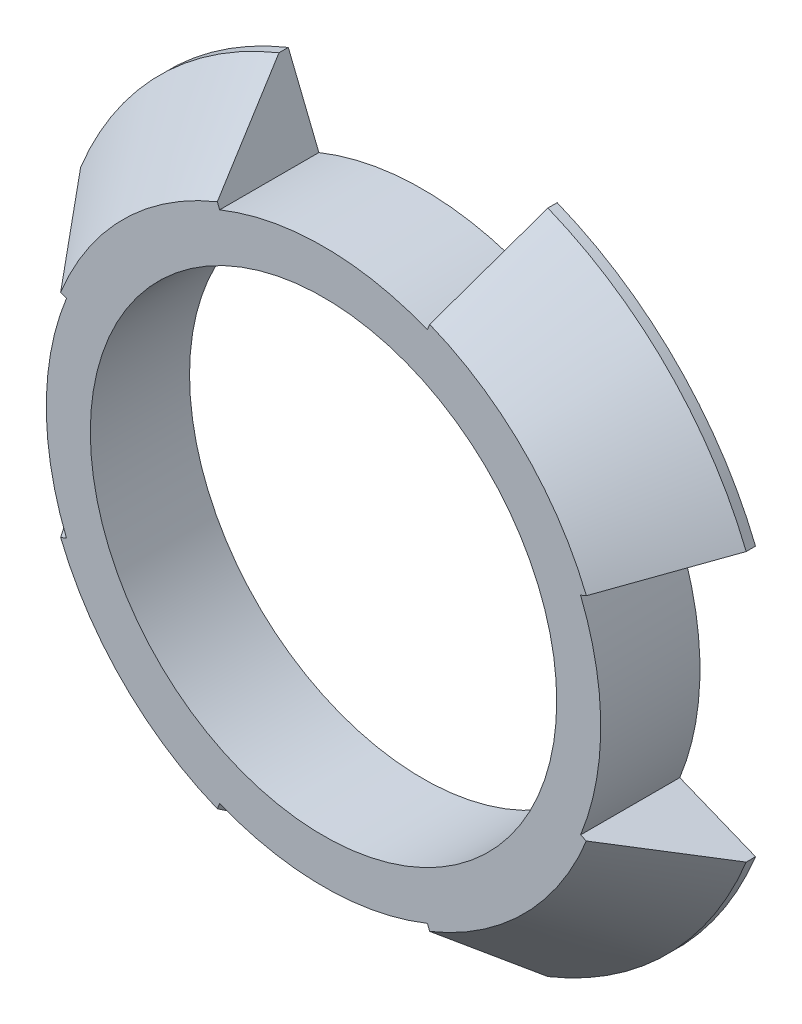
ISO-10303-21;
HEADER;
FILE_DESCRIPTION(('STEP AP214'),'2;1');
FILE_NAME('part.step','',(''),(''),'','','');
FILE_SCHEMA(('AUTOMOTIVE_DESIGN { 1 0 10303 214 1 1 1 1 }'));
ENDSEC;
DATA;
#1=APPLICATION_CONTEXT('core data for automotive mechanical design processes');
#2=APPLICATION_PROTOCOL_DEFINITION('international standard','automotive_design',2000,#1);
#3=PRODUCT_CONTEXT('',#1,'mechanical');
#4=PRODUCT('Part','Part','',(#3));
#5=PRODUCT_RELATED_PRODUCT_CATEGORY('part','',(#4));
#6=PRODUCT_DEFINITION_FORMATION('','',#4);
#7=PRODUCT_DEFINITION_CONTEXT('part definition',#1,'design');
#8=PRODUCT_DEFINITION('design','',#6,#7);
#9=PRODUCT_DEFINITION_SHAPE('','',#8);
#10=(LENGTH_UNIT() NAMED_UNIT(*) SI_UNIT(.MILLI.,.METRE.));
#11=(NAMED_UNIT(*) PLANE_ANGLE_UNIT() SI_UNIT($,.RADIAN.));
#12=(NAMED_UNIT(*) SI_UNIT($,.STERADIAN.) SOLID_ANGLE_UNIT());
#13=UNCERTAINTY_MEASURE_WITH_UNIT(LENGTH_MEASURE(1.E-05),#10,'distance_accuracy_value','');
#14=(GEOMETRIC_REPRESENTATION_CONTEXT(3) GLOBAL_UNCERTAINTY_ASSIGNED_CONTEXT((#13)) GLOBAL_UNIT_ASSIGNED_CONTEXT((#10,
#11,#12)) REPRESENTATION_CONTEXT('',''));
#15=CARTESIAN_POINT('',(0.,0.,0.));
#16=DIRECTION('',(0.,0.,1.));
#17=DIRECTION('',(1.,0.,0.));
#18=AXIS2_PLACEMENT_3D('',#15,#16,#17);
#19=CARTESIAN_POINT('',(-12.0825477842231,-4.88166617973261,4.318));
#20=DIRECTION('',(-0.374606593415913,0.927183854566787,0.));
#21=DIRECTION('',(-0.927183854566787,-0.374606593415913,0.));
#22=AXIS2_PLACEMENT_3D('',#19,#20,#21);
#23=PLANE('',#22);
#24=DIRECTION('',(0.,0.,1.));
#25=VECTOR('',#24,1.);
#26=CARTESIAN_POINT('',(14.4835389921878,5.85172959574998,-0.762));
#27=LINE('',#26,#25);
#28=CARTESIAN_POINT('',(14.4835389921878,5.85172959574998,0.405352706259439));
#29=VERTEX_POINT('',#28);
#30=CARTESIAN_POINT('',(14.4835389921878,5.85172959574998,0.));
#31=VERTEX_POINT('',#30);
#32=EDGE_CURVE('E316',#29,#31,#27,.F.);
#33=ORIENTED_EDGE('',*,*,#32,.F.);
#34=DIRECTION('',(0.595982293616936,0.240792476754632,-0.76604444311898));
#35=VECTOR('',#34,1.);
#36=CARTESIAN_POINT('',(0.,0.,19.0217355761737));
#37=LINE('',#36,#35);
#38=CARTESIAN_POINT('',(11.43950084377,4.62185835134652,4.318));
#39=VERTEX_POINT('',#38);
#40=EDGE_CURVE('E201',#29,#39,#37,.F.);
#41=ORIENTED_EDGE('',*,*,#40,.T.);
#42=DIRECTION('',(0.927183854566787,0.374606593415913,0.));
#43=VECTOR('',#42,1.);
#44=CARTESIAN_POINT('',(-12.0825477842231,-4.88166617973261,4.318));
#45=LINE('',#44,#43);
#46=CARTESIAN_POINT('',(11.1864732053483,4.519628549563,4.318));
#47=VERTEX_POINT('',#46);
#48=EDGE_CURVE('E299',#47,#39,#45,.T.);
#49=ORIENTED_EDGE('',*,*,#48,.F.);
#50=DIRECTION('',(0.,0.,-1.));
#51=VECTOR('',#50,1.);
#52=CARTESIAN_POINT('',(11.1864732053483,4.519628549563,4.318));
#53=LINE('',#52,#51);
#54=CARTESIAN_POINT('',(11.1864732053483,4.519628549563,0.));
#55=VERTEX_POINT('',#54);
#56=EDGE_CURVE('E221',#47,#55,#53,.T.);
#57=ORIENTED_EDGE('',*,*,#56,.T.);
#58=DIRECTION('',(0.927183854566787,0.374606593415913,0.));
#59=VECTOR('',#58,1.);
#60=CARTESIAN_POINT('',(-12.0825477842231,-4.88166617973261,0.));
#61=LINE('',#60,#59);
#62=EDGE_CURVE('E267',#55,#31,#61,.T.);
#63=ORIENTED_EDGE('',*,*,#62,.T.);
#64=EDGE_LOOP('',(#33,#41,#49,#57,#63));
#65=FACE_BOUND('',#64,.T.);
#66=ADVANCED_FACE('F36',(#65),#23,.F.);
#67=CARTESIAN_POINT('',(-12.0825477842231,-29.9053551765047,4.318));
#68=DIRECTION('',(-0.927183854566787,0.374606593415913,0.));
#69=DIRECTION('',(-0.374606593415913,-0.927183854566787,0.));
#70=AXIS2_PLACEMENT_3D('',#67,#68,#69);
#71=PLANE('',#70);
#72=DIRECTION('',(0.240792476754631,0.595982293616936,-0.76604444311898));
#73=VECTOR('',#72,1.);
#74=CARTESIAN_POINT('',(0.,0.,19.0217355761737));
#75=LINE('',#74,#73);
#76=CARTESIAN_POINT('',(4.62185835134651,11.43950084377,4.318));
#77=VERTEX_POINT('',#76);
#78=CARTESIAN_POINT('',(5.85172959574997,14.4835389921878,0.405352706259439));
#79=VERTEX_POINT('',#78);
#80=EDGE_CURVE('E203',#77,#79,#75,.T.);
#81=ORIENTED_EDGE('',*,*,#80,.T.);
#82=DIRECTION('',(0.,0.,1.));
#83=VECTOR('',#82,1.);
#84=CARTESIAN_POINT('',(5.85172959574997,14.4835389921878,-0.762));
#85=LINE('',#84,#83);
#86=CARTESIAN_POINT('',(5.85172959574997,14.4835389921878,0.));
#87=VERTEX_POINT('',#86);
#88=EDGE_CURVE('E59',#79,#87,#85,.F.);
#89=ORIENTED_EDGE('',*,*,#88,.T.);
#90=DIRECTION('',(0.374606593415913,0.927183854566787,0.));
#91=VECTOR('',#90,1.);
#92=CARTESIAN_POINT('',(-12.0825477842231,-29.9053551765047,0.));
#93=LINE('',#92,#91);
#94=CARTESIAN_POINT('',(4.51962854956299,11.1864732053483,0.));
#95=VERTEX_POINT('',#94);
#96=EDGE_CURVE('E264',#95,#87,#93,.T.);
#97=ORIENTED_EDGE('',*,*,#96,.F.);
#98=DIRECTION('',(0.,0.,-1.));
#99=VECTOR('',#98,1.);
#100=CARTESIAN_POINT('',(4.51962854956299,11.1864732053483,4.318));
#101=LINE('',#100,#99);
#102=CARTESIAN_POINT('',(4.51962854956299,11.1864732053483,4.318));
#103=VERTEX_POINT('',#102);
#104=EDGE_CURVE('E224',#103,#95,#101,.T.);
#105=ORIENTED_EDGE('',*,*,#104,.F.);
#106=DIRECTION('',(0.374606593415913,0.927183854566787,0.));
#107=VECTOR('',#106,1.);
#108=CARTESIAN_POINT('',(-12.0825477842231,-29.9053551765047,4.318));
#109=LINE('',#108,#107);
#110=EDGE_CURVE('E296',#103,#77,#109,.T.);
#111=ORIENTED_EDGE('',*,*,#110,.T.);
#112=EDGE_LOOP('',(#81,#89,#97,#105,#111));
#113=FACE_BOUND('',#112,.T.);
#114=ADVANCED_FACE('F372',(#113),#71,.T.);
#115=CARTESIAN_POINT('',(12.0825477842231,-29.9053551765047,4.318));
#116=DIRECTION('',(-0.927183854566787,-0.374606593415913,0.));
#117=DIRECTION('',(0.374606593415913,-0.927183854566787,0.));
#118=AXIS2_PLACEMENT_3D('',#115,#116,#117);
#119=PLANE('',#118);
#120=DIRECTION('',(0.,0.,1.));
#121=VECTOR('',#120,1.);
#122=CARTESIAN_POINT('',(-5.85172959574998,14.4835389921878,-0.762));
#123=LINE('',#122,#121);
#124=CARTESIAN_POINT('',(-5.85172959574998,14.4835389921878,0.405352706259439));
#125=VERTEX_POINT('',#124);
#126=CARTESIAN_POINT('',(-5.85172959574998,14.4835389921878,0.));
#127=VERTEX_POINT('',#126);
#128=EDGE_CURVE('E310',#125,#127,#123,.F.);
#129=ORIENTED_EDGE('',*,*,#128,.F.);
#130=DIRECTION('',(-0.240792476754632,0.595982293616935,-0.766044443118979));
#131=VECTOR('',#130,1.);
#132=CARTESIAN_POINT('',(0.,0.,19.0217355761737));
#133=LINE('',#132,#131);
#134=CARTESIAN_POINT('',(-4.62185835134652,11.43950084377,4.318));
#135=VERTEX_POINT('',#134);
#136=EDGE_CURVE('E206',#125,#135,#133,.F.);
#137=ORIENTED_EDGE('',*,*,#136,.T.);
#138=DIRECTION('',(-0.374606593415913,0.927183854566787,0.));
#139=VECTOR('',#138,1.);
#140=CARTESIAN_POINT('',(12.0825477842231,-29.9053551765047,4.318));
#141=LINE('',#140,#139);
#142=CARTESIAN_POINT('',(-4.51962854956299,11.1864732053483,4.318));
#143=VERTEX_POINT('',#142);
#144=EDGE_CURVE('E291',#143,#135,#141,.T.);
#145=ORIENTED_EDGE('',*,*,#144,.F.);
#146=DIRECTION('',(0.,0.,-1.));
#147=VECTOR('',#146,1.);
#148=CARTESIAN_POINT('',(-4.51962854956299,11.1864732053483,4.318));
#149=LINE('',#148,#147);
#150=CARTESIAN_POINT('',(-4.51962854956299,11.1864732053483,0.));
#151=VERTEX_POINT('',#150);
#152=EDGE_CURVE('E226',#143,#151,#149,.T.);
#153=ORIENTED_EDGE('',*,*,#152,.T.);
#154=DIRECTION('',(-0.374606593415913,0.927183854566787,0.));
#155=VECTOR('',#154,1.);
#156=CARTESIAN_POINT('',(12.0825477842231,-29.9053551765047,0.));
#157=LINE('',#156,#155);
#158=EDGE_CURVE('E259',#151,#127,#157,.T.);
#159=ORIENTED_EDGE('',*,*,#158,.T.);
#160=EDGE_LOOP('',(#129,#137,#145,#153,#159));
#161=FACE_BOUND('',#160,.T.);
#162=ADVANCED_FACE('F397',(#161),#119,.F.);
#163=CARTESIAN_POINT('',(12.0825477842231,-4.8816661797326,4.318));
#164=DIRECTION('',(-0.374606593415913,-0.927183854566787,0.));
#165=DIRECTION('',(0.927183854566787,-0.374606593415913,0.));
#166=AXIS2_PLACEMENT_3D('',#163,#164,#165);
#167=PLANE('',#166);
#168=DIRECTION('',(-0.595982293616936,0.240792476754631,-0.76604444311898));
#169=VECTOR('',#168,1.);
#170=CARTESIAN_POINT('',(0.,0.,19.0217355761737));
#171=LINE('',#170,#169);
#172=CARTESIAN_POINT('',(-11.43950084377,4.62185835134651,4.318));
#173=VERTEX_POINT('',#172);
#174=CARTESIAN_POINT('',(-14.4835389921878,5.85172959574997,0.405352706259439));
#175=VERTEX_POINT('',#174);
#176=EDGE_CURVE('E208',#173,#175,#171,.T.);
#177=ORIENTED_EDGE('',*,*,#176,.T.);
#178=DIRECTION('',(0.,0.,1.));
#179=VECTOR('',#178,1.);
#180=CARTESIAN_POINT('',(-14.4835389921878,5.85172959574997,-0.762));
#181=LINE('',#180,#179);
#182=CARTESIAN_POINT('',(-14.4835389921878,5.85172959574997,0.));
#183=VERTEX_POINT('',#182);
#184=EDGE_CURVE('E51',#175,#183,#181,.F.);
#185=ORIENTED_EDGE('',*,*,#184,.T.);
#186=DIRECTION('',(-0.927183854566787,0.374606593415913,0.));
#187=VECTOR('',#186,1.);
#188=CARTESIAN_POINT('',(12.0825477842231,-4.8816661797326,0.));
#189=LINE('',#188,#187);
#190=CARTESIAN_POINT('',(-11.1864732053483,4.51962854956299,0.));
#191=VERTEX_POINT('',#190);
#192=EDGE_CURVE('E256',#191,#183,#189,.T.);
#193=ORIENTED_EDGE('',*,*,#192,.F.);
#194=DIRECTION('',(0.,0.,-1.));
#195=VECTOR('',#194,1.);
#196=CARTESIAN_POINT('',(-11.1864732053483,4.51962854956299,4.318));
#197=LINE('',#196,#195);
#198=CARTESIAN_POINT('',(-11.1864732053483,4.51962854956299,4.318));
#199=VERTEX_POINT('',#198);
#200=EDGE_CURVE('E229',#199,#191,#197,.T.);
#201=ORIENTED_EDGE('',*,*,#200,.F.);
#202=DIRECTION('',(-0.927183854566787,0.374606593415913,0.));
#203=VECTOR('',#202,1.);
#204=CARTESIAN_POINT('',(12.0825477842231,-4.8816661797326,4.318));
#205=LINE('',#204,#203);
#206=EDGE_CURVE('E288',#199,#173,#205,.T.);
#207=ORIENTED_EDGE('',*,*,#206,.T.);
#208=EDGE_LOOP('',(#177,#185,#193,#201,#207));
#209=FACE_BOUND('',#208,.T.);
#210=ADVANCED_FACE('F387',(#209),#167,.T.);
#211=CARTESIAN_POINT('',(-12.0825477842231,-4.88166617973262,4.318));
#212=DIRECTION('',(0.374606593415913,-0.927183854566787,0.));
#213=DIRECTION('',(0.927183854566787,0.374606593415913,0.));
#214=AXIS2_PLACEMENT_3D('',#211,#212,#213);
#215=PLANE('',#214);
#216=DIRECTION('',(0.,0.,1.));
#217=VECTOR('',#216,1.);
#218=CARTESIAN_POINT('',(-14.4835389921878,-5.85172959574999,-0.762));
#219=LINE('',#218,#217);
#220=CARTESIAN_POINT('',(-14.4835389921878,-5.85172959574999,0.405352706259446));
#221=VERTEX_POINT('',#220);
#222=CARTESIAN_POINT('',(-14.4835389921878,-5.85172959574999,0.));
#223=VERTEX_POINT('',#222);
#224=EDGE_CURVE('E173',#221,#223,#219,.F.);
#225=ORIENTED_EDGE('',*,*,#224,.F.);
#226=DIRECTION('',(-0.595982293616935,-0.240792476754632,-0.76604444311898));
#227=VECTOR('',#226,1.);
#228=CARTESIAN_POINT('',(0.,0.,19.0217355761737));
#229=LINE('',#228,#227);
#230=CARTESIAN_POINT('',(-11.43950084377,-4.62185835134653,4.318));
#231=VERTEX_POINT('',#230);
#232=EDGE_CURVE('E44',#221,#231,#229,.F.);
#233=ORIENTED_EDGE('',*,*,#232,.T.);
#234=DIRECTION('',(-0.927183854566787,-0.374606593415913,0.));
#235=VECTOR('',#234,1.);
#236=CARTESIAN_POINT('',(-12.0825477842231,-4.88166617973262,4.318));
#237=LINE('',#236,#235);
#238=CARTESIAN_POINT('',(-11.1864732053483,-4.519628549563,4.318));
#239=VERTEX_POINT('',#238);
#240=EDGE_CURVE('E284',#239,#231,#237,.T.);
#241=ORIENTED_EDGE('',*,*,#240,.F.);
#242=DIRECTION('',(0.,0.,-1.));
#243=VECTOR('',#242,1.);
#244=CARTESIAN_POINT('',(-11.1864732053483,-4.519628549563,4.318));
#245=LINE('',#244,#243);
#246=CARTESIAN_POINT('',(-11.1864732053483,-4.519628549563,0.));
#247=VERTEX_POINT('',#246);
#248=EDGE_CURVE('E231',#239,#247,#245,.T.);
#249=ORIENTED_EDGE('',*,*,#248,.T.);
#250=DIRECTION('',(-0.927183854566787,-0.374606593415913,0.));
#251=VECTOR('',#250,1.);
#252=CARTESIAN_POINT('',(-12.0825477842231,-4.88166617973262,0.));
#253=LINE('',#252,#251);
#254=EDGE_CURVE('E187',#247,#223,#253,.T.);
#255=ORIENTED_EDGE('',*,*,#254,.T.);
#256=EDGE_LOOP('',(#225,#233,#241,#249,#255));
#257=FACE_BOUND('',#256,.T.);
#258=ADVANCED_FACE('F182',(#257),#215,.F.);
#259=CARTESIAN_POINT('',(-12.0825477842231,-29.9053551765047,4.318));
#260=DIRECTION('',(0.927183854566787,-0.374606593415913,0.));
#261=DIRECTION('',(0.374606593415913,0.927183854566787,0.));
#262=AXIS2_PLACEMENT_3D('',#259,#260,#261);
#263=PLANE('',#262);
#264=DIRECTION('',(-0.240792476754631,-0.595982293616935,-0.76604444311898));
#265=VECTOR('',#264,1.);
#266=CARTESIAN_POINT('',(0.,0.,19.0217355761737));
#267=LINE('',#266,#265);
#268=CARTESIAN_POINT('',(-4.62185835134653,-11.4395008437701,4.31799999999998));
#269=VERTEX_POINT('',#268);
#270=CARTESIAN_POINT('',(-5.85172959574997,-14.4835389921878,0.405352706259446));
#271=VERTEX_POINT('',#270);
#272=EDGE_CURVE('E193',#269,#271,#267,.T.);
#273=ORIENTED_EDGE('',*,*,#272,.T.);
#274=DIRECTION('',(0.,0.,1.));
#275=VECTOR('',#274,1.);
#276=CARTESIAN_POINT('',(-5.85172959574997,-14.4835389921878,-0.762));
#277=LINE('',#276,#275);
#278=CARTESIAN_POINT('',(-5.85172959574997,-14.4835389921878,0.));
#279=VERTEX_POINT('',#278);
#280=EDGE_CURVE('E176',#271,#279,#277,.F.);
#281=ORIENTED_EDGE('',*,*,#280,.T.);
#282=DIRECTION('',(-0.374606593415913,-0.927183854566787,0.));
#283=VECTOR('',#282,1.);
#284=CARTESIAN_POINT('',(-12.0825477842231,-29.9053551765047,0.));
#285=LINE('',#284,#283);
#286=CARTESIAN_POINT('',(-4.51962854956299,-11.1864732053483,0.));
#287=VERTEX_POINT('',#286);
#288=EDGE_CURVE('E250',#287,#279,#285,.T.);
#289=ORIENTED_EDGE('',*,*,#288,.F.);
#290=DIRECTION('',(0.,0.,-1.));
#291=VECTOR('',#290,1.);
#292=CARTESIAN_POINT('',(-4.51962854956299,-11.1864732053483,4.318));
#293=LINE('',#292,#291);
#294=CARTESIAN_POINT('',(-4.51962854956299,-11.1864732053483,4.318));
#295=VERTEX_POINT('',#294);
#296=EDGE_CURVE('E233',#295,#287,#293,.T.);
#297=ORIENTED_EDGE('',*,*,#296,.F.);
#298=DIRECTION('',(-0.374606593415913,-0.927183854566787,0.));
#299=VECTOR('',#298,1.);
#300=CARTESIAN_POINT('',(-12.0825477842231,-29.9053551765047,4.318));
#301=LINE('',#300,#299);
#302=EDGE_CURVE('E281',#295,#269,#301,.T.);
#303=ORIENTED_EDGE('',*,*,#302,.T.);
#304=EDGE_LOOP('',(#273,#281,#289,#297,#303));
#305=FACE_BOUND('',#304,.T.);
#306=ADVANCED_FACE('F333',(#305),#263,.T.);
#307=CARTESIAN_POINT('',(12.0825477842231,-29.9053551765047,4.318));
#308=DIRECTION('',(0.927183854566787,0.374606593415913,0.));
#309=DIRECTION('',(-0.374606593415913,0.927183854566787,0.));
#310=AXIS2_PLACEMENT_3D('',#307,#308,#309);
#311=PLANE('',#310);
#312=DIRECTION('',(0.,0.,1.));
#313=VECTOR('',#312,1.);
#314=CARTESIAN_POINT('',(5.85172959574998,-14.4835389921878,-0.762));
#315=LINE('',#314,#313);
#316=CARTESIAN_POINT('',(5.85172959574998,-14.4835389921878,0.405352706259435));
#317=VERTEX_POINT('',#316);
#318=CARTESIAN_POINT('',(5.85172959574998,-14.4835389921878,0.));
#319=VERTEX_POINT('',#318);
#320=EDGE_CURVE('E322',#317,#319,#315,.F.);
#321=ORIENTED_EDGE('',*,*,#320,.F.);
#322=DIRECTION('',(0.240792476754631,-0.595982293616935,-0.76604444311898));
#323=VECTOR('',#322,1.);
#324=CARTESIAN_POINT('',(0.,0.,19.0217355761737));
#325=LINE('',#324,#323);
#326=CARTESIAN_POINT('',(4.62185835134653,-11.4395008437701,4.31799999999999));
#327=VERTEX_POINT('',#326);
#328=EDGE_CURVE('E194',#317,#327,#325,.F.);
#329=ORIENTED_EDGE('',*,*,#328,.T.);
#330=DIRECTION('',(0.374606593415913,-0.927183854566787,0.));
#331=VECTOR('',#330,1.);
#332=CARTESIAN_POINT('',(12.0825477842231,-29.9053551765047,4.318));
#333=LINE('',#332,#331);
#334=CARTESIAN_POINT('',(4.519628549563,-11.1864732053483,4.318));
#335=VERTEX_POINT('',#334);
#336=EDGE_CURVE('E276',#335,#327,#333,.T.);
#337=ORIENTED_EDGE('',*,*,#336,.F.);
#338=DIRECTION('',(0.,0.,-1.));
#339=VECTOR('',#338,1.);
#340=CARTESIAN_POINT('',(4.519628549563,-11.1864732053483,4.318));
#341=LINE('',#340,#339);
#342=CARTESIAN_POINT('',(4.519628549563,-11.1864732053483,0.));
#343=VERTEX_POINT('',#342);
#344=EDGE_CURVE('E235',#335,#343,#341,.T.);
#345=ORIENTED_EDGE('',*,*,#344,.T.);
#346=DIRECTION('',(0.374606593415913,-0.927183854566787,0.));
#347=VECTOR('',#346,1.);
#348=CARTESIAN_POINT('',(12.0825477842231,-29.9053551765047,0.));
#349=LINE('',#348,#347);
#350=EDGE_CURVE('E245',#343,#319,#349,.T.);
#351=ORIENTED_EDGE('',*,*,#350,.T.);
#352=EDGE_LOOP('',(#321,#329,#337,#345,#351));
#353=FACE_BOUND('',#352,.T.);
#354=ADVANCED_FACE('F347',(#353),#311,.F.);
#355=CARTESIAN_POINT('',(12.0825477842231,-4.8816661797326,4.318));
#356=DIRECTION('',(0.374606593415913,0.927183854566787,0.));
#357=DIRECTION('',(-0.927183854566787,0.374606593415913,0.));
#358=AXIS2_PLACEMENT_3D('',#355,#356,#357);
#359=PLANE('',#358);
#360=DIRECTION('',(0.595982293616935,-0.240792476754631,-0.76604444311898));
#361=VECTOR('',#360,1.);
#362=CARTESIAN_POINT('',(0.,0.,19.0217355761737));
#363=LINE('',#362,#361);
#364=CARTESIAN_POINT('',(11.43950084377,-4.62185835134651,4.318));
#365=VERTEX_POINT('',#364);
#366=CARTESIAN_POINT('',(14.4835389921878,-5.85172959574997,0.405352706259435));
#367=VERTEX_POINT('',#366);
#368=EDGE_CURVE('E198',#365,#367,#363,.T.);
#369=ORIENTED_EDGE('',*,*,#368,.T.);
#370=DIRECTION('',(0.,0.,1.));
#371=VECTOR('',#370,1.);
#372=CARTESIAN_POINT('',(14.4835389921878,-5.85172959574997,-0.762));
#373=LINE('',#372,#371);
#374=CARTESIAN_POINT('',(14.4835389921878,-5.85172959574997,0.));
#375=VERTEX_POINT('',#374);
#376=EDGE_CURVE('E324',#367,#375,#373,.F.);
#377=ORIENTED_EDGE('',*,*,#376,.T.);
#378=DIRECTION('',(0.927183854566787,-0.374606593415913,0.));
#379=VECTOR('',#378,1.);
#380=CARTESIAN_POINT('',(12.0825477842231,-4.8816661797326,0.));
#381=LINE('',#380,#379);
#382=CARTESIAN_POINT('',(11.1864732053483,-4.51962854956299,0.));
#383=VERTEX_POINT('',#382);
#384=EDGE_CURVE('E241',#383,#375,#381,.T.);
#385=ORIENTED_EDGE('',*,*,#384,.F.);
#386=DIRECTION('',(0.,0.,-1.));
#387=VECTOR('',#386,1.);
#388=CARTESIAN_POINT('',(11.1864732053483,-4.51962854956299,4.318));
#389=LINE('',#388,#387);
#390=CARTESIAN_POINT('',(11.1864732053483,-4.51962854956299,4.318));
#391=VERTEX_POINT('',#390);
#392=EDGE_CURVE('E238',#391,#383,#389,.T.);
#393=ORIENTED_EDGE('',*,*,#392,.F.);
#394=DIRECTION('',(0.927183854566787,-0.374606593415913,0.));
#395=VECTOR('',#394,1.);
#396=CARTESIAN_POINT('',(12.0825477842231,-4.8816661797326,4.318));
#397=LINE('',#396,#395);
#398=EDGE_CURVE('E240',#391,#365,#397,.T.);
#399=ORIENTED_EDGE('',*,*,#398,.T.);
#400=EDGE_LOOP('',(#369,#377,#385,#393,#399));
#401=FACE_BOUND('',#400,.T.);
#402=ADVANCED_FACE('F357',(#401),#359,.T.);
#403=CARTESIAN_POINT('',(0.,-34.7870213562373,0.));
#404=DIRECTION('',(0.,0.,1.));
#405=DIRECTION('',(1.,0.,0.));
#406=AXIS2_PLACEMENT_3D('',#403,#404,#405);
#407=PLANE('',#406);
#408=CARTESIAN_POINT('',(0.,0.,0.));
#409=DIRECTION('',(0.,0.,1.));
#410=DIRECTION('',(1.,0.,0.));
#411=AXIS2_PLACEMENT_3D('',#408,#409,#410);
#412=CIRCLE('',#411,10.1493855221771);
#413=CARTESIAN_POINT('',(10.1493855221771,0.,0.));
#414=VERTEX_POINT('',#413);
#415=EDGE_CURVE('E273',#414,#414,#412,.T.);
#416=ORIENTED_EDGE('',*,*,#415,.T.);
#417=EDGE_LOOP('',(#416));
#418=FACE_BOUND('',#417,.T.);
#419=CARTESIAN_POINT('',(0.,0.,0.));
#420=DIRECTION('',(0.,0.,1.));
#421=DIRECTION('',(1.,0.,0.));
#422=AXIS2_PLACEMENT_3D('',#419,#420,#421);
#423=CIRCLE('',#422,15.621);
#424=EDGE_CURVE('E315',#31,#87,#423,.T.);
#425=ORIENTED_EDGE('',*,*,#424,.F.);
#426=ORIENTED_EDGE('',*,*,#62,.F.);
#427=CARTESIAN_POINT('',(0.,0.,0.));
#428=DIRECTION('',(0.,0.,1.));
#429=DIRECTION('',(1.,0.,0.));
#430=AXIS2_PLACEMENT_3D('',#427,#428,#429);
#431=CIRCLE('',#430,12.065);
#432=EDGE_CURVE('E270',#383,#55,#431,.T.);
#433=ORIENTED_EDGE('',*,*,#432,.F.);
#434=ORIENTED_EDGE('',*,*,#384,.T.);
#435=EDGE_CURVE('E321',#319,#375,#423,.T.);
#436=ORIENTED_EDGE('',*,*,#435,.F.);
#437=ORIENTED_EDGE('',*,*,#350,.F.);
#438=CARTESIAN_POINT('',(0.,0.,0.));
#439=DIRECTION('',(0.,0.,1.));
#440=DIRECTION('',(1.,0.,0.));
#441=AXIS2_PLACEMENT_3D('',#438,#439,#440);
#442=CIRCLE('',#441,12.065);
#443=EDGE_CURVE('E248',#287,#343,#442,.T.);
#444=ORIENTED_EDGE('',*,*,#443,.F.);
#445=ORIENTED_EDGE('',*,*,#288,.T.);
#446=EDGE_CURVE('E188',#223,#279,#423,.T.);
#447=ORIENTED_EDGE('',*,*,#446,.F.);
#448=ORIENTED_EDGE('',*,*,#254,.F.);
#449=CARTESIAN_POINT('',(0.,0.,0.));
#450=DIRECTION('',(0.,0.,1.));
#451=DIRECTION('',(1.,0.,0.));
#452=AXIS2_PLACEMENT_3D('',#449,#450,#451);
#453=CIRCLE('',#452,12.065);
#454=EDGE_CURVE('E254',#191,#247,#453,.T.);
#455=ORIENTED_EDGE('',*,*,#454,.F.);
#456=ORIENTED_EDGE('',*,*,#192,.T.);
#457=EDGE_CURVE('E307',#127,#183,#423,.T.);
#458=ORIENTED_EDGE('',*,*,#457,.F.);
#459=ORIENTED_EDGE('',*,*,#158,.F.);
#460=CARTESIAN_POINT('',(0.,0.,0.));
#461=DIRECTION('',(0.,0.,1.));
#462=DIRECTION('',(1.,0.,0.));
#463=AXIS2_PLACEMENT_3D('',#460,#461,#462);
#464=CIRCLE('',#463,12.065);
#465=EDGE_CURVE('E262',#95,#151,#464,.T.);
#466=ORIENTED_EDGE('',*,*,#465,.F.);
#467=ORIENTED_EDGE('',*,*,#96,.T.);
#468=EDGE_LOOP('',(#425,#426,#433,#434,#436,#437,#444,#445,#447,#448,#455,#456,#458,#459,#466,#467));
#469=FACE_BOUND('',#468,.T.);
#470=ADVANCED_FACE('F337',(#418,#469),#407,.F.);
#471=CARTESIAN_POINT('',(0.,0.,4.318));
#472=DIRECTION('',(0.,0.,-1.));
#473=DIRECTION('',(-1.,0.,0.));
#474=AXIS2_PLACEMENT_3D('',#471,#472,#473);
#475=CONICAL_SURFACE('',#474,12.3378990988955,0.69813170079773);
#476=ORIENTED_EDGE('',*,*,#136,.F.);
#477=CARTESIAN_POINT('',(0.,0.,0.405352706259439));
#478=DIRECTION('',(0.,0.,-1.));
#479=DIRECTION('',(-1.,0.,0.));
#480=AXIS2_PLACEMENT_3D('',#477,#478,#479);
#481=CIRCLE('',#480,15.621);
#482=EDGE_CURVE('E313',#125,#175,#481,.F.);
#483=ORIENTED_EDGE('',*,*,#482,.T.);
#484=ORIENTED_EDGE('',*,*,#176,.F.);
#485=CARTESIAN_POINT('',(0.,0.,4.318));
#486=DIRECTION('',(0.,0.,1.));
#487=DIRECTION('',(1.,0.,0.));
#488=AXIS2_PLACEMENT_3D('',#485,#486,#487);
#489=CIRCLE('',#488,12.3378990988955);
#490=EDGE_CURVE('E211',#135,#173,#489,.T.);
#491=ORIENTED_EDGE('',*,*,#490,.F.);
#492=EDGE_LOOP('',(#476,#483,#484,#491));
#493=FACE_BOUND('',#492,.T.);
#494=ADVANCED_FACE('F385',(#493),#475,.T.);
#495=CARTESIAN_POINT('',(0.,0.,4.318));
#496=DIRECTION('',(0.,0.,-1.));
#497=DIRECTION('',(-1.,0.,0.));
#498=AXIS2_PLACEMENT_3D('',#495,#496,#497);
#499=CONICAL_SURFACE('',#498,12.3378990988955,0.69813170079773);
#500=ORIENTED_EDGE('',*,*,#40,.F.);
#501=CARTESIAN_POINT('',(0.,0.,0.405352706259439));
#502=DIRECTION('',(0.,0.,-1.));
#503=DIRECTION('',(-1.,0.,0.));
#504=AXIS2_PLACEMENT_3D('',#501,#502,#503);
#505=CIRCLE('',#504,15.621);
#506=EDGE_CURVE('E319',#29,#79,#505,.F.);
#507=ORIENTED_EDGE('',*,*,#506,.T.);
#508=ORIENTED_EDGE('',*,*,#80,.F.);
#509=CARTESIAN_POINT('',(0.,0.,4.318));
#510=DIRECTION('',(0.,0.,1.));
#511=DIRECTION('',(1.,0.,0.));
#512=AXIS2_PLACEMENT_3D('',#509,#510,#511);
#513=CIRCLE('',#512,12.3378990988955);
#514=EDGE_CURVE('E214',#39,#77,#513,.T.);
#515=ORIENTED_EDGE('',*,*,#514,.F.);
#516=EDGE_LOOP('',(#500,#507,#508,#515));
#517=FACE_BOUND('',#516,.T.);
#518=ADVANCED_FACE('F369',(#517),#499,.T.);
#519=CARTESIAN_POINT('',(0.,0.,4.318));
#520=DIRECTION('',(0.,0.,-1.));
#521=DIRECTION('',(-1.,0.,0.));
#522=AXIS2_PLACEMENT_3D('',#519,#520,#521);
#523=CONICAL_SURFACE('',#522,12.3378990988955,0.698131700797729);
#524=ORIENTED_EDGE('',*,*,#328,.F.);
#525=CARTESIAN_POINT('',(0.,0.,0.405352706259435));
#526=DIRECTION('',(0.,0.,-1.));
#527=DIRECTION('',(-1.,0.,0.));
#528=AXIS2_PLACEMENT_3D('',#525,#526,#527);
#529=CIRCLE('',#528,15.621);
#530=EDGE_CURVE('E327',#317,#367,#529,.F.);
#531=ORIENTED_EDGE('',*,*,#530,.T.);
#532=ORIENTED_EDGE('',*,*,#368,.F.);
#533=CARTESIAN_POINT('',(0.,0.,4.318));
#534=DIRECTION('',(0.,0.,1.));
#535=DIRECTION('',(1.,0.,0.));
#536=AXIS2_PLACEMENT_3D('',#533,#534,#535);
#537=CIRCLE('',#536,12.3378990988955);
#538=EDGE_CURVE('E217',#327,#365,#537,.T.);
#539=ORIENTED_EDGE('',*,*,#538,.F.);
#540=EDGE_LOOP('',(#524,#531,#532,#539));
#541=FACE_BOUND('',#540,.T.);
#542=ADVANCED_FACE('F355',(#541),#523,.T.);
#543=CARTESIAN_POINT('',(0.,0.,4.318));
#544=DIRECTION('',(0.,0.,-1.));
#545=DIRECTION('',(-1.,0.,0.));
#546=AXIS2_PLACEMENT_3D('',#543,#544,#545);
#547=CONICAL_SURFACE('',#546,12.3378990988955,0.698131700797729);
#548=ORIENTED_EDGE('',*,*,#232,.F.);
#549=CARTESIAN_POINT('',(0.,0.,0.405352706259446));
#550=DIRECTION('',(0.,0.,-1.));
#551=DIRECTION('',(-1.,0.,0.));
#552=AXIS2_PLACEMENT_3D('',#549,#550,#551);
#553=CIRCLE('',#552,15.621);
#554=EDGE_CURVE('E11',#221,#271,#553,.F.);
#555=ORIENTED_EDGE('',*,*,#554,.T.);
#556=ORIENTED_EDGE('',*,*,#272,.F.);
#557=CARTESIAN_POINT('',(0.,0.,4.318));
#558=DIRECTION('',(0.,0.,1.));
#559=DIRECTION('',(1.,0.,0.));
#560=AXIS2_PLACEMENT_3D('',#557,#558,#559);
#561=CIRCLE('',#560,12.3378990988955);
#562=EDGE_CURVE('E192',#231,#269,#561,.T.);
#563=ORIENTED_EDGE('',*,*,#562,.F.);
#564=EDGE_LOOP('',(#548,#555,#556,#563));
#565=FACE_BOUND('',#564,.T.);
#566=ADVANCED_FACE('F38',(#565),#547,.T.);
#567=CARTESIAN_POINT('',(0.,0.,4.318));
#568=DIRECTION('',(0.,0.,-1.));
#569=DIRECTION('',(-1.,0.,0.));
#570=AXIS2_PLACEMENT_3D('',#567,#568,#569);
#571=CYLINDRICAL_SURFACE('',#570,12.065);
#572=ORIENTED_EDGE('',*,*,#432,.T.);
#573=ORIENTED_EDGE('',*,*,#56,.F.);
#574=CARTESIAN_POINT('',(0.,0.,4.318));
#575=DIRECTION('',(0.,0.,1.));
#576=DIRECTION('',(1.,0.,0.));
#577=AXIS2_PLACEMENT_3D('',#574,#575,#576);
#578=CIRCLE('',#577,12.065);
#579=EDGE_CURVE('E244',#391,#47,#578,.T.);
#580=ORIENTED_EDGE('',*,*,#579,.F.);
#581=ORIENTED_EDGE('',*,*,#392,.T.);
#582=EDGE_LOOP('',(#572,#573,#580,#581));
#583=FACE_BOUND('',#582,.T.);
#584=ADVANCED_FACE('F363',(#583),#571,.T.);
#585=CARTESIAN_POINT('',(0.,0.,4.318));
#586=DIRECTION('',(0.,0.,-1.));
#587=DIRECTION('',(-1.,0.,0.));
#588=AXIS2_PLACEMENT_3D('',#585,#586,#587);
#589=CYLINDRICAL_SURFACE('',#588,12.065);
#590=ORIENTED_EDGE('',*,*,#465,.T.);
#591=ORIENTED_EDGE('',*,*,#152,.F.);
#592=CARTESIAN_POINT('',(0.,0.,4.318));
#593=DIRECTION('',(0.,0.,1.));
#594=DIRECTION('',(1.,0.,0.));
#595=AXIS2_PLACEMENT_3D('',#592,#593,#594);
#596=CIRCLE('',#595,12.065);
#597=EDGE_CURVE('E294',#103,#143,#596,.T.);
#598=ORIENTED_EDGE('',*,*,#597,.F.);
#599=ORIENTED_EDGE('',*,*,#104,.T.);
#600=EDGE_LOOP('',(#590,#591,#598,#599));
#601=FACE_BOUND('',#600,.T.);
#602=ADVANCED_FACE('F378',(#601),#589,.T.);
#603=CARTESIAN_POINT('',(0.,0.,4.318));
#604=DIRECTION('',(0.,0.,-1.));
#605=DIRECTION('',(-1.,0.,0.));
#606=AXIS2_PLACEMENT_3D('',#603,#604,#605);
#607=CYLINDRICAL_SURFACE('',#606,12.065);
#608=ORIENTED_EDGE('',*,*,#454,.T.);
#609=ORIENTED_EDGE('',*,*,#248,.F.);
#610=CARTESIAN_POINT('',(0.,0.,4.318));
#611=DIRECTION('',(0.,0.,1.));
#612=DIRECTION('',(1.,0.,0.));
#613=AXIS2_PLACEMENT_3D('',#610,#611,#612);
#614=CIRCLE('',#613,12.065);
#615=EDGE_CURVE('E286',#199,#239,#614,.T.);
#616=ORIENTED_EDGE('',*,*,#615,.F.);
#617=ORIENTED_EDGE('',*,*,#200,.T.);
#618=EDGE_LOOP('',(#608,#609,#616,#617));
#619=FACE_BOUND('',#618,.T.);
#620=ADVANCED_FACE('F392',(#619),#607,.T.);
#621=CARTESIAN_POINT('',(0.,0.,4.318));
#622=DIRECTION('',(0.,0.,-1.));
#623=DIRECTION('',(-1.,0.,0.));
#624=AXIS2_PLACEMENT_3D('',#621,#622,#623);
#625=CYLINDRICAL_SURFACE('',#624,12.065);
#626=ORIENTED_EDGE('',*,*,#443,.T.);
#627=ORIENTED_EDGE('',*,*,#344,.F.);
#628=CARTESIAN_POINT('',(0.,0.,4.318));
#629=DIRECTION('',(0.,0.,1.));
#630=DIRECTION('',(1.,0.,0.));
#631=AXIS2_PLACEMENT_3D('',#628,#629,#630);
#632=CIRCLE('',#631,12.065);
#633=EDGE_CURVE('E279',#295,#335,#632,.T.);
#634=ORIENTED_EDGE('',*,*,#633,.F.);
#635=ORIENTED_EDGE('',*,*,#296,.T.);
#636=EDGE_LOOP('',(#626,#627,#634,#635));
#637=FACE_BOUND('',#636,.T.);
#638=ADVANCED_FACE('F342',(#637),#625,.T.);
#639=CARTESIAN_POINT('',(0.,-34.7870213562373,4.318));
#640=DIRECTION('',(0.,0.,1.));
#641=DIRECTION('',(1.,0.,0.));
#642=AXIS2_PLACEMENT_3D('',#639,#640,#641);
#643=PLANE('',#642);
#644=CARTESIAN_POINT('',(0.,0.,4.318));
#645=DIRECTION('',(0.,0.,1.));
#646=DIRECTION('',(1.,0.,0.));
#647=AXIS2_PLACEMENT_3D('',#644,#645,#646);
#648=CIRCLE('',#647,10.1493855221771);
#649=CARTESIAN_POINT('',(10.1493855221771,0.,4.318));
#650=VERTEX_POINT('',#649);
#651=EDGE_CURVE('E304',#650,#650,#648,.T.);
#652=ORIENTED_EDGE('',*,*,#651,.F.);
#653=EDGE_LOOP('',(#652));
#654=FACE_BOUND('',#653,.T.);
#655=ORIENTED_EDGE('',*,*,#144,.T.);
#656=ORIENTED_EDGE('',*,*,#490,.T.);
#657=ORIENTED_EDGE('',*,*,#206,.F.);
#658=ORIENTED_EDGE('',*,*,#615,.T.);
#659=ORIENTED_EDGE('',*,*,#240,.T.);
#660=ORIENTED_EDGE('',*,*,#562,.T.);
#661=ORIENTED_EDGE('',*,*,#302,.F.);
#662=ORIENTED_EDGE('',*,*,#633,.T.);
#663=ORIENTED_EDGE('',*,*,#336,.T.);
#664=ORIENTED_EDGE('',*,*,#538,.T.);
#665=ORIENTED_EDGE('',*,*,#398,.F.);
#666=ORIENTED_EDGE('',*,*,#579,.T.);
#667=ORIENTED_EDGE('',*,*,#48,.T.);
#668=ORIENTED_EDGE('',*,*,#514,.T.);
#669=ORIENTED_EDGE('',*,*,#110,.F.);
#670=ORIENTED_EDGE('',*,*,#597,.T.);
#671=EDGE_LOOP('',(#655,#656,#657,#658,#659,#660,#661,#662,#663,#664,#665,#666,#667,#668,#669,#670));
#672=FACE_BOUND('',#671,.T.);
#673=ADVANCED_FACE('F351',(#654,#672),#643,.T.);
#674=CARTESIAN_POINT('',(0.,0.,0.));
#675=DIRECTION('',(0.,0.,1.));
#676=DIRECTION('',(1.,0.,0.));
#677=AXIS2_PLACEMENT_3D('',#674,#675,#676);
#678=CYLINDRICAL_SURFACE('',#677,10.1493855221771);
#679=ORIENTED_EDGE('',*,*,#415,.F.);
#680=EDGE_LOOP('',(#679));
#681=FACE_BOUND('',#680,.T.);
#682=ORIENTED_EDGE('',*,*,#651,.T.);
#683=EDGE_LOOP('',(#682));
#684=FACE_BOUND('',#683,.T.);
#685=ADVANCED_FACE('F408',(#681,#684),#678,.F.);
#686=CARTESIAN_POINT('',(0.,0.,-0.762));
#687=DIRECTION('',(0.,0.,1.));
#688=DIRECTION('',(1.,0.,0.));
#689=AXIS2_PLACEMENT_3D('',#686,#687,#688);
#690=CYLINDRICAL_SURFACE('',#689,15.621);
#691=ORIENTED_EDGE('',*,*,#446,.T.);
#692=ORIENTED_EDGE('',*,*,#280,.F.);
#693=ORIENTED_EDGE('',*,*,#554,.F.);
#694=ORIENTED_EDGE('',*,*,#224,.T.);
#695=EDGE_LOOP('',(#691,#692,#693,#694));
#696=FACE_BOUND('',#695,.T.);
#697=ADVANCED_FACE('F172',(#696),#690,.T.);
#698=ORIENTED_EDGE('',*,*,#435,.T.);
#699=ORIENTED_EDGE('',*,*,#376,.F.);
#700=ORIENTED_EDGE('',*,*,#530,.F.);
#701=ORIENTED_EDGE('',*,*,#320,.T.);
#702=EDGE_LOOP('',(#698,#699,#700,#701));
#703=FACE_BOUND('',#702,.T.);
#704=ADVANCED_FACE('F405',(#703),#690,.T.);
#705=ORIENTED_EDGE('',*,*,#424,.T.);
#706=ORIENTED_EDGE('',*,*,#88,.F.);
#707=ORIENTED_EDGE('',*,*,#506,.F.);
#708=ORIENTED_EDGE('',*,*,#32,.T.);
#709=EDGE_LOOP('',(#705,#706,#707,#708));
#710=FACE_BOUND('',#709,.T.);
#711=ADVANCED_FACE('F400',(#710),#690,.T.);
#712=ORIENTED_EDGE('',*,*,#457,.T.);
#713=ORIENTED_EDGE('',*,*,#184,.F.);
#714=ORIENTED_EDGE('',*,*,#482,.F.);
#715=ORIENTED_EDGE('',*,*,#128,.T.);
#716=EDGE_LOOP('',(#712,#713,#714,#715));
#717=FACE_BOUND('',#716,.T.);
#718=ADVANCED_FACE('F398',(#717),#690,.T.);
#719=CLOSED_SHELL('',(#66,#114,#162,#210,#258,#306,#354,#402,#470,#494,#518,#542,#566,#584,#602,
#620,#638,#673,#685,#697,#704,#711,#718));
#720=MANIFOLD_SOLID_BREP('B2',#719);
#721=ADVANCED_BREP_SHAPE_REPRESENTATION('',(#18,#720),#14);
#722=SHAPE_DEFINITION_REPRESENTATION(#9,#721);
ENDSEC;
END-ISO-10303-21;
